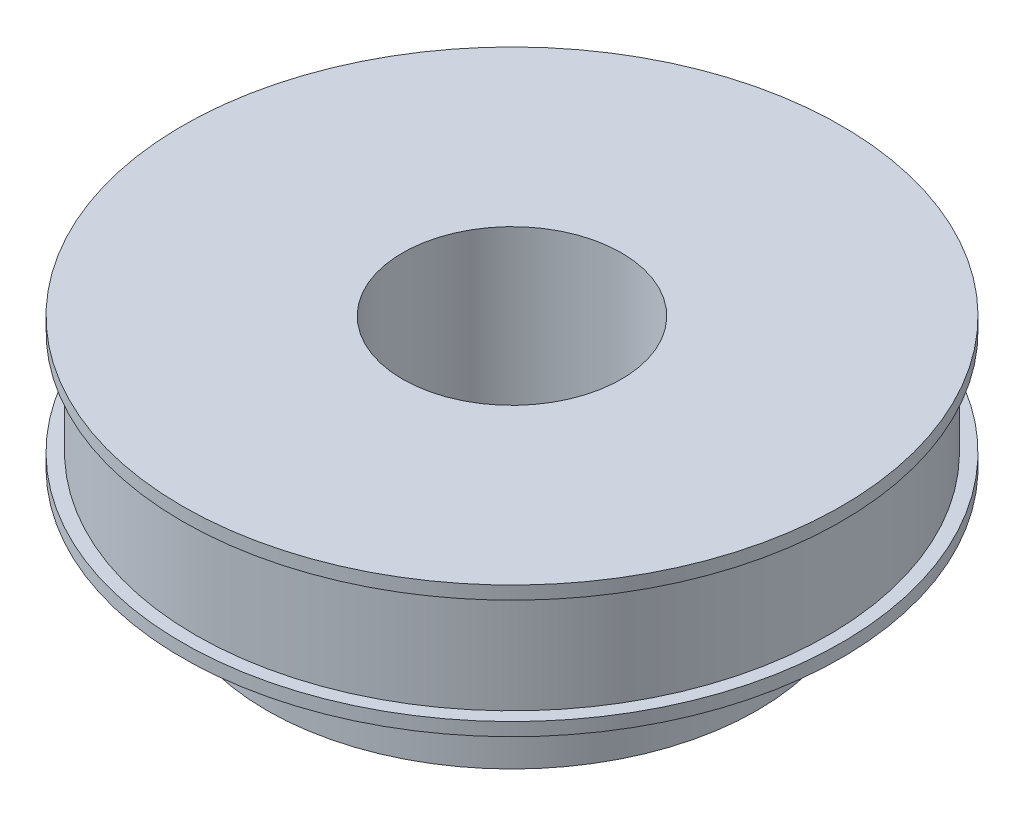
ISO-10303-21;
HEADER;
FILE_DESCRIPTION(('STEP AP214'),'2;1');
FILE_NAME('part.step','',(''),(''),'','','');
FILE_SCHEMA(('AUTOMOTIVE_DESIGN { 1 0 10303 214 1 1 1 1 }'));
ENDSEC;
DATA;
#1=APPLICATION_CONTEXT('core data for automotive mechanical design processes');
#2=APPLICATION_PROTOCOL_DEFINITION('international standard','automotive_design',2000,#1);
#3=PRODUCT_CONTEXT('',#1,'mechanical');
#4=PRODUCT('Part','Part','',(#3));
#5=PRODUCT_RELATED_PRODUCT_CATEGORY('part','',(#4));
#6=PRODUCT_DEFINITION_FORMATION('','',#4);
#7=PRODUCT_DEFINITION_CONTEXT('part definition',#1,'design');
#8=PRODUCT_DEFINITION('design','',#6,#7);
#9=PRODUCT_DEFINITION_SHAPE('','',#8);
#10=(LENGTH_UNIT() NAMED_UNIT(*) SI_UNIT(.MILLI.,.METRE.));
#11=(NAMED_UNIT(*) PLANE_ANGLE_UNIT() SI_UNIT($,.RADIAN.));
#12=(NAMED_UNIT(*) SI_UNIT($,.STERADIAN.) SOLID_ANGLE_UNIT());
#13=UNCERTAINTY_MEASURE_WITH_UNIT(LENGTH_MEASURE(1.E-05),#10,'distance_accuracy_value','');
#14=(GEOMETRIC_REPRESENTATION_CONTEXT(3) GLOBAL_UNCERTAINTY_ASSIGNED_CONTEXT((#13)) GLOBAL_UNIT_ASSIGNED_CONTEXT((#10,
#11,#12)) REPRESENTATION_CONTEXT('',''));
#15=CARTESIAN_POINT('',(0.,0.,0.));
#16=DIRECTION('',(0.,0.,1.));
#17=DIRECTION('',(1.,0.,0.));
#18=AXIS2_PLACEMENT_3D('',#15,#16,#17);
#19=CARTESIAN_POINT('',(0.,12.,0.));
#20=DIRECTION('',(0.,-1.,0.));
#21=DIRECTION('',(0.,0.,-1.));
#22=AXIS2_PLACEMENT_3D('',#19,#20,#21);
#23=CYLINDRICAL_SURFACE('',#22,36.125);
#24=CARTESIAN_POINT('',(0.,12.,0.));
#25=DIRECTION('',(0.,1.,0.));
#26=DIRECTION('',(0.,0.,1.));
#27=AXIS2_PLACEMENT_3D('',#24,#25,#26);
#28=CIRCLE('',#27,36.125);
#29=CARTESIAN_POINT('',(0.,12.,36.125));
#30=VERTEX_POINT('',#29);
#31=EDGE_CURVE('E45',#30,#30,#28,.T.);
#32=ORIENTED_EDGE('',*,*,#31,.F.);
#33=EDGE_LOOP('',(#32));
#34=FACE_BOUND('',#33,.T.);
#35=CARTESIAN_POINT('',(0.,0.,0.));
#36=DIRECTION('',(0.,1.,0.));
#37=DIRECTION('',(0.,0.,1.));
#38=AXIS2_PLACEMENT_3D('',#35,#36,#37);
#39=CIRCLE('',#38,36.125);
#40=CARTESIAN_POINT('',(0.,0.,36.125));
#41=VERTEX_POINT('',#40);
#42=EDGE_CURVE('E40',#41,#41,#39,.T.);
#43=ORIENTED_EDGE('',*,*,#42,.T.);
#44=EDGE_LOOP('',(#43));
#45=FACE_BOUND('',#44,.T.);
#46=ADVANCED_FACE('F37',(#34,#45),#23,.T.);
#47=CARTESIAN_POINT('',(0.,13.5,0.));
#48=DIRECTION('',(0.,-1.,0.));
#49=DIRECTION('',(0.,0.,-1.));
#50=AXIS2_PLACEMENT_3D('',#47,#48,#49);
#51=CYLINDRICAL_SURFACE('',#50,37.625);
#52=CARTESIAN_POINT('',(0.,13.5,0.));
#53=DIRECTION('',(0.,1.,0.));
#54=DIRECTION('',(0.,0.,1.));
#55=AXIS2_PLACEMENT_3D('',#52,#53,#54);
#56=CIRCLE('',#55,37.625);
#57=CARTESIAN_POINT('',(0.,13.5,37.625));
#58=VERTEX_POINT('',#57);
#59=EDGE_CURVE('E51',#58,#58,#56,.T.);
#60=ORIENTED_EDGE('',*,*,#59,.F.);
#61=EDGE_LOOP('',(#60));
#62=FACE_BOUND('',#61,.T.);
#63=CARTESIAN_POINT('',(0.,12.,0.));
#64=DIRECTION('',(0.,1.,0.));
#65=DIRECTION('',(0.,0.,1.));
#66=AXIS2_PLACEMENT_3D('',#63,#64,#65);
#67=CIRCLE('',#66,37.625);
#68=CARTESIAN_POINT('',(0.,12.,37.625));
#69=VERTEX_POINT('',#68);
#70=EDGE_CURVE('E67',#69,#69,#67,.T.);
#71=ORIENTED_EDGE('',*,*,#70,.T.);
#72=EDGE_LOOP('',(#71));
#73=FACE_BOUND('',#72,.T.);
#74=ADVANCED_FACE('F102',(#62,#73),#51,.T.);
#75=CARTESIAN_POINT('',(0.,13.5,0.));
#76=DIRECTION('',(0.,1.,0.));
#77=DIRECTION('',(0.,0.,1.));
#78=AXIS2_PLACEMENT_3D('',#75,#76,#77);
#79=PLANE('',#78);
#80=CARTESIAN_POINT('',(0.,13.5,0.));
#81=DIRECTION('',(0.,1.,0.));
#82=DIRECTION('',(0.,0.,1.));
#83=AXIS2_PLACEMENT_3D('',#80,#81,#82);
#84=CIRCLE('',#83,12.5);
#85=CARTESIAN_POINT('',(0.,13.5,12.5));
#86=VERTEX_POINT('',#85);
#87=EDGE_CURVE('E120',#86,#86,#84,.T.);
#88=ORIENTED_EDGE('',*,*,#87,.F.);
#89=EDGE_LOOP('',(#88));
#90=FACE_BOUND('',#89,.T.);
#91=ORIENTED_EDGE('',*,*,#59,.T.);
#92=EDGE_LOOP('',(#91));
#93=FACE_BOUND('',#92,.T.);
#94=ADVANCED_FACE('F96',(#90,#93),#79,.T.);
#95=CARTESIAN_POINT('',(0.,12.,0.));
#96=DIRECTION('',(0.,1.,0.));
#97=DIRECTION('',(0.,0.,1.));
#98=AXIS2_PLACEMENT_3D('',#95,#96,#97);
#99=PLANE('',#98);
#100=ORIENTED_EDGE('',*,*,#31,.T.);
#101=EDGE_LOOP('',(#100));
#102=FACE_BOUND('',#101,.T.);
#103=ORIENTED_EDGE('',*,*,#70,.F.);
#104=EDGE_LOOP('',(#103));
#105=FACE_BOUND('',#104,.T.);
#106=ADVANCED_FACE('F87',(#102,#105),#99,.F.);
#107=CARTESIAN_POINT('',(0.,-1.5,0.));
#108=DIRECTION('',(0.,1.,0.));
#109=DIRECTION('',(0.,0.,1.));
#110=AXIS2_PLACEMENT_3D('',#107,#108,#109);
#111=CYLINDRICAL_SURFACE('',#110,37.625);
#112=CARTESIAN_POINT('',(0.,-1.5,0.));
#113=DIRECTION('',(0.,-1.,0.));
#114=DIRECTION('',(0.,0.,-1.));
#115=AXIS2_PLACEMENT_3D('',#112,#113,#114);
#116=CIRCLE('',#115,37.625);
#117=CARTESIAN_POINT('',(0.,-1.5,-37.625));
#118=VERTEX_POINT('',#117);
#119=EDGE_CURVE('E56',#118,#118,#116,.T.);
#120=ORIENTED_EDGE('',*,*,#119,.F.);
#121=EDGE_LOOP('',(#120));
#122=FACE_BOUND('',#121,.T.);
#123=CARTESIAN_POINT('',(0.,0.,0.));
#124=DIRECTION('',(0.,-1.,0.));
#125=DIRECTION('',(0.,0.,-1.));
#126=AXIS2_PLACEMENT_3D('',#123,#124,#125);
#127=CIRCLE('',#126,37.625);
#128=CARTESIAN_POINT('',(0.,0.,-37.625));
#129=VERTEX_POINT('',#128);
#130=EDGE_CURVE('E60',#129,#129,#127,.T.);
#131=ORIENTED_EDGE('',*,*,#130,.T.);
#132=EDGE_LOOP('',(#131));
#133=FACE_BOUND('',#132,.T.);
#134=ADVANCED_FACE('F85',(#122,#133),#111,.T.);
#135=CARTESIAN_POINT('',(0.,-1.5,0.));
#136=DIRECTION('',(0.,-1.,0.));
#137=DIRECTION('',(0.,0.,-1.));
#138=AXIS2_PLACEMENT_3D('',#135,#136,#137);
#139=PLANE('',#138);
#140=CARTESIAN_POINT('',(0.,-1.5,0.));
#141=DIRECTION('',(0.,-1.,0.));
#142=DIRECTION('',(0.,0.,-1.));
#143=AXIS2_PLACEMENT_3D('',#140,#141,#142);
#144=CIRCLE('',#143,28.);
#145=CARTESIAN_POINT('',(0.,-1.5,-28.));
#146=VERTEX_POINT('',#145);
#147=EDGE_CURVE('E10',#146,#146,#144,.T.);
#148=ORIENTED_EDGE('',*,*,#147,.F.);
#149=EDGE_LOOP('',(#148));
#150=FACE_BOUND('',#149,.T.);
#151=ORIENTED_EDGE('',*,*,#119,.T.);
#152=EDGE_LOOP('',(#151));
#153=FACE_BOUND('',#152,.T.);
#154=ADVANCED_FACE('F81',(#150,#153),#139,.T.);
#155=CARTESIAN_POINT('',(0.,0.,0.));
#156=DIRECTION('',(0.,-1.,0.));
#157=DIRECTION('',(0.,0.,-1.));
#158=AXIS2_PLACEMENT_3D('',#155,#156,#157);
#159=PLANE('',#158);
#160=ORIENTED_EDGE('',*,*,#42,.F.);
#161=EDGE_LOOP('',(#160));
#162=FACE_BOUND('',#161,.T.);
#163=ORIENTED_EDGE('',*,*,#130,.F.);
#164=EDGE_LOOP('',(#163));
#165=FACE_BOUND('',#164,.T.);
#166=ADVANCED_FACE('F77',(#162,#165),#159,.F.);
#167=CARTESIAN_POINT('',(0.,-11.5,0.));
#168=DIRECTION('',(0.,1.,0.));
#169=DIRECTION('',(0.,0.,1.));
#170=AXIS2_PLACEMENT_3D('',#167,#168,#169);
#171=CYLINDRICAL_SURFACE('',#170,28.);
#172=CARTESIAN_POINT('',(0.,-11.5,0.));
#173=DIRECTION('',(0.,-1.,0.));
#174=DIRECTION('',(0.,0.,-1.));
#175=AXIS2_PLACEMENT_3D('',#172,#173,#174);
#176=CIRCLE('',#175,28.);
#177=CARTESIAN_POINT('',(0.,-11.5,-28.));
#178=VERTEX_POINT('',#177);
#179=EDGE_CURVE('E54',#178,#178,#176,.T.);
#180=ORIENTED_EDGE('',*,*,#179,.F.);
#181=EDGE_LOOP('',(#180));
#182=FACE_BOUND('',#181,.T.);
#183=ORIENTED_EDGE('',*,*,#147,.T.);
#184=EDGE_LOOP('',(#183));
#185=FACE_BOUND('',#184,.T.);
#186=ADVANCED_FACE('F80',(#182,#185),#171,.T.);
#187=CARTESIAN_POINT('',(0.,-11.5,0.));
#188=DIRECTION('',(0.,-1.,0.));
#189=DIRECTION('',(0.,0.,-1.));
#190=AXIS2_PLACEMENT_3D('',#187,#188,#189);
#191=PLANE('',#190);
#192=CARTESIAN_POINT('',(0.,-11.5,0.));
#193=DIRECTION('',(0.,-1.,0.));
#194=DIRECTION('',(0.,0.,-1.));
#195=AXIS2_PLACEMENT_3D('',#192,#193,#194);
#196=CIRCLE('',#195,12.5);
#197=CARTESIAN_POINT('',(0.,-11.5,-12.5));
#198=VERTEX_POINT('',#197);
#199=EDGE_CURVE('E123',#198,#198,#196,.F.);
#200=ORIENTED_EDGE('',*,*,#199,.T.);
#201=EDGE_LOOP('',(#200));
#202=FACE_BOUND('',#201,.T.);
#203=ORIENTED_EDGE('',*,*,#179,.T.);
#204=EDGE_LOOP('',(#203));
#205=FACE_BOUND('',#204,.T.);
#206=ADVANCED_FACE('F133',(#202,#205),#191,.T.);
#207=CARTESIAN_POINT('',(0.,-46.8553390593274,0.));
#208=DIRECTION('',(0.,1.,0.));
#209=DIRECTION('',(0.,0.,1.));
#210=AXIS2_PLACEMENT_3D('',#207,#208,#209);
#211=CYLINDRICAL_SURFACE('',#210,12.5);
#212=ORIENTED_EDGE('',*,*,#87,.T.);
#213=EDGE_LOOP('',(#212));
#214=FACE_BOUND('',#213,.T.);
#215=ORIENTED_EDGE('',*,*,#199,.F.);
#216=EDGE_LOOP('',(#215));
#217=FACE_BOUND('',#216,.T.);
#218=ADVANCED_FACE('F140',(#214,#217),#211,.F.);
#219=CLOSED_SHELL('',(#46,#74,#94,#106,#134,#154,#166,#186,#206,#218));
#220=MANIFOLD_SOLID_BREP('B2',#219);
#221=ADVANCED_BREP_SHAPE_REPRESENTATION('',(#18,#220),#14);
#222=SHAPE_DEFINITION_REPRESENTATION(#9,#221);
ENDSEC;
END-ISO-10303-21;
